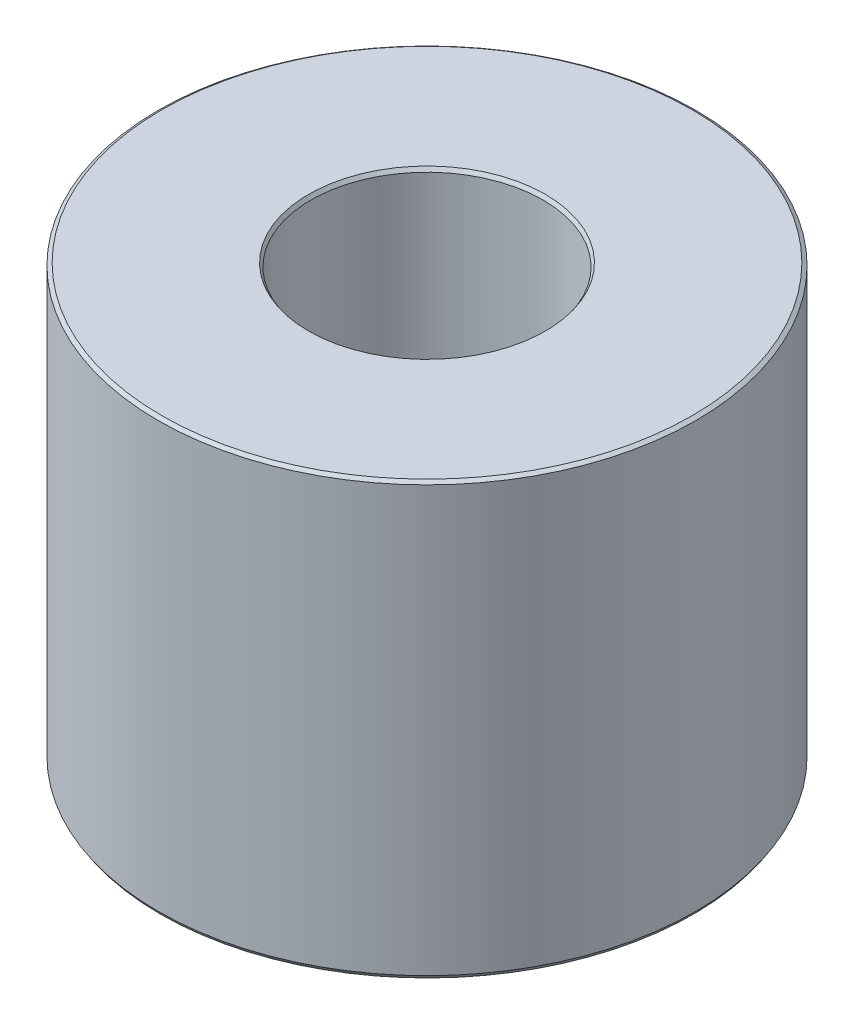
ISO-10303-21;
HEADER;
FILE_DESCRIPTION(('STEP AP214'),'2;1');
FILE_NAME('part.step','',(''),(''),'','','');
FILE_SCHEMA(('AUTOMOTIVE_DESIGN { 1 0 10303 214 1 1 1 1 }'));
ENDSEC;
DATA;
#1=APPLICATION_CONTEXT('core data for automotive mechanical design processes');
#2=APPLICATION_PROTOCOL_DEFINITION('international standard','automotive_design',2000,#1);
#3=PRODUCT_CONTEXT('',#1,'mechanical');
#4=PRODUCT('Part','Part','',(#3));
#5=PRODUCT_RELATED_PRODUCT_CATEGORY('part','',(#4));
#6=PRODUCT_DEFINITION_FORMATION('','',#4);
#7=PRODUCT_DEFINITION_CONTEXT('part definition',#1,'design');
#8=PRODUCT_DEFINITION('design','',#6,#7);
#9=PRODUCT_DEFINITION_SHAPE('','',#8);
#10=(LENGTH_UNIT() NAMED_UNIT(*) SI_UNIT(.MILLI.,.METRE.));
#11=(NAMED_UNIT(*) PLANE_ANGLE_UNIT() SI_UNIT($,.RADIAN.));
#12=(NAMED_UNIT(*) SI_UNIT($,.STERADIAN.) SOLID_ANGLE_UNIT());
#13=UNCERTAINTY_MEASURE_WITH_UNIT(LENGTH_MEASURE(1.E-05),#10,'distance_accuracy_value','');
#14=(GEOMETRIC_REPRESENTATION_CONTEXT(3) GLOBAL_UNCERTAINTY_ASSIGNED_CONTEXT((#13)) GLOBAL_UNIT_ASSIGNED_CONTEXT((#10,
#11,#12)) REPRESENTATION_CONTEXT('',''));
#15=CARTESIAN_POINT('',(0.,0.,0.));
#16=DIRECTION('',(0.,0.,1.));
#17=DIRECTION('',(1.,0.,0.));
#18=AXIS2_PLACEMENT_3D('',#15,#16,#17);
#19=CARTESIAN_POINT('',(0.,92.2311962001684,0.));
#20=DIRECTION('',(0.,-1.,0.));
#21=DIRECTION('',(0.,0.,-1.));
#22=AXIS2_PLACEMENT_3D('',#19,#20,#21);
#23=CYLINDRICAL_SURFACE('',#22,57.5);
#24=CARTESIAN_POINT('',(0.,0.786990859813083,0.));
#25=DIRECTION('',(0.,1.,0.));
#26=DIRECTION('',(0.,0.,1.));
#27=AXIS2_PLACEMENT_3D('',#24,#25,#26);
#28=CIRCLE('',#27,57.5);
#29=CARTESIAN_POINT('',(0.,0.786990859813083,-57.5));
#30=VERTEX_POINT('',#29);
#31=EDGE_CURVE('E10',#30,#30,#28,.T.);
#32=CARTESIAN_POINT('',(0.,91.7238870551304,0.));
#33=DIRECTION('',(0.,1.,0.));
#34=DIRECTION('',(0.,0.,1.));
#35=AXIS2_PLACEMENT_3D('',#32,#33,#34);
#36=CIRCLE('',#35,57.5);
#37=CARTESIAN_POINT('',(0.,91.7238870551304,-57.5));
#38=VERTEX_POINT('',#37);
#39=EDGE_CURVE('E50',#38,#38,#36,.F.);
#40=CARTESIAN_POINT('',(0.,0.786990859813083,-57.5));
#41=CARTESIAN_POINT('',(0.,1.73425019518097,-57.5));
#42=CARTESIAN_POINT('',(0.,2.68150953054886,-57.5));
#43=CARTESIAN_POINT('',(0.,4.57602820128464,-57.5));
#44=CARTESIAN_POINT('',(0.,5.52328753665253,-57.5));
#45=CARTESIAN_POINT('',(0.,7.41780620738831,-57.5));
#46=CARTESIAN_POINT('',(0.,8.3650655427562,-57.5));
#47=CARTESIAN_POINT('',(0.,10.259584213492,-57.5));
#48=CARTESIAN_POINT('',(0.,11.2068435488599,-57.5));
#49=CARTESIAN_POINT('',(0.,13.1013622195956,-57.5));
#50=CARTESIAN_POINT('',(0.,14.0486215549635,-57.5));
#51=CARTESIAN_POINT('',(0.,15.9431402256993,-57.5));
#52=CARTESIAN_POINT('',(0.,16.8903995610672,-57.5));
#53=CARTESIAN_POINT('',(0.,18.784918231803,-57.5));
#54=CARTESIAN_POINT('',(0.,19.7321775671709,-57.5));
#55=CARTESIAN_POINT('',(0.,21.6266962379066,-57.5));
#56=CARTESIAN_POINT('',(0.,22.5739555732745,-57.5));
#57=CARTESIAN_POINT('',(0.,24.4684742440103,-57.5));
#58=CARTESIAN_POINT('',(0.,25.4157335793782,-57.5));
#59=CARTESIAN_POINT('',(0.,27.310252250114,-57.5));
#60=CARTESIAN_POINT('',(0.,28.2575115854819,-57.5));
#61=CARTESIAN_POINT('',(0.,30.1520302562176,-57.5));
#62=CARTESIAN_POINT('',(0.,31.0992895915855,-57.5));
#63=CARTESIAN_POINT('',(0.,32.9938082623213,-57.5));
#64=CARTESIAN_POINT('',(0.,33.9410675976892,-57.5));
#65=CARTESIAN_POINT('',(0.,35.835586268425,-57.5));
#66=CARTESIAN_POINT('',(0.,36.7828456037929,-57.5));
#67=CARTESIAN_POINT('',(0.,38.6773642745286,-57.5));
#68=CARTESIAN_POINT('',(0.,39.6246236098965,-57.5));
#69=CARTESIAN_POINT('',(0.,41.5191422806323,-57.5));
#70=CARTESIAN_POINT('',(0.,42.4664016160002,-57.5));
#71=CARTESIAN_POINT('',(0.,44.360920286736,-57.5));
#72=CARTESIAN_POINT('',(0.,45.3081796221039,-57.5));
#73=CARTESIAN_POINT('',(0.,47.2026982928396,-57.5));
#74=CARTESIAN_POINT('',(0.,48.1499576282075,-57.5));
#75=CARTESIAN_POINT('',(0.,50.0444762989433,-57.5));
#76=CARTESIAN_POINT('',(0.,50.9917356343112,-57.5));
#77=CARTESIAN_POINT('',(0.,52.886254305047,-57.5));
#78=CARTESIAN_POINT('',(0.,53.8335136404149,-57.5));
#79=CARTESIAN_POINT('',(0.,55.7280323111506,-57.5));
#80=CARTESIAN_POINT('',(0.,56.6752916465185,-57.5));
#81=CARTESIAN_POINT('',(0.,58.5698103172543,-57.5));
#82=CARTESIAN_POINT('',(0.,59.5170696526222,-57.5));
#83=CARTESIAN_POINT('',(0.,61.411588323358,-57.5));
#84=CARTESIAN_POINT('',(0.,62.3588476587259,-57.5));
#85=CARTESIAN_POINT('',(0.,64.2533663294616,-57.5));
#86=CARTESIAN_POINT('',(0.,65.2006256648295,-57.5));
#87=CARTESIAN_POINT('',(0.,67.0951443355653,-57.5));
#88=CARTESIAN_POINT('',(0.,68.0424036709332,-57.5));
#89=CARTESIAN_POINT('',(0.,69.936922341669,-57.5));
#90=CARTESIAN_POINT('',(0.,70.8841816770369,-57.5));
#91=CARTESIAN_POINT('',(0.,72.7787003477726,-57.5));
#92=CARTESIAN_POINT('',(0.,73.7259596831405,-57.5));
#93=CARTESIAN_POINT('',(0.,75.6204783538763,-57.5));
#94=CARTESIAN_POINT('',(0.,76.5677376892442,-57.5));
#95=CARTESIAN_POINT('',(0.,78.46225635998,-57.5));
#96=CARTESIAN_POINT('',(0.,79.4095156953479,-57.5));
#97=CARTESIAN_POINT('',(0.,81.3040343660836,-57.5));
#98=CARTESIAN_POINT('',(0.,82.2512937014515,-57.5));
#99=CARTESIAN_POINT('',(0.,84.1458123721873,-57.5));
#100=CARTESIAN_POINT('',(0.,85.0930717075552,-57.5));
#101=CARTESIAN_POINT('',(0.,86.987590378291,-57.5));
#102=CARTESIAN_POINT('',(0.,87.9348497136589,-57.5));
#103=CARTESIAN_POINT('',(0.,89.8293683843947,-57.5));
#104=CARTESIAN_POINT('',(0.,90.7766277197625,-57.5));
#105=CARTESIAN_POINT('',(0.,91.7238870551304,-57.5));
#106=B_SPLINE_CURVE_WITH_KNOTS('',3,(#40,#41,#42,#43,#44,#45,#46,#47,#48,#49,#50,#51,#52,#53,
#54,#55,#56,#57,#58,#59,#60,#61,#62,#63,#64,#65,#66,#67,#68,#69,#70,#71,#72,#73,#74,#75,#76,#77,
#78,#79,#80,#81,#82,#83,#84,#85,#86,#87,#88,#89,#90,#91,#92,#93,#94,#95,#96,#97,#98,#99,#100,
#101,#102,#103,#104,#105),.UNSPECIFIED.,.F.,.F.,(4,2,2,2,2,2,2,2,2,2,2,2,2,2,2,2,2,2,2,2,2,2,2,
2,2,2,2,2,2,2,2,2,4),(0.,2.84177800610366,5.68355601220734,8.525334018311,11.3671120244147,
14.2088900305183,17.050668036622,19.8924460427257,22.7342240488293,25.576002054933,
28.4177800610367,31.2595580671403,34.101336073244,36.9431140793477,39.7848920854513,
42.626670091555,45.4684480976587,48.3102261037623,51.152004109866,53.9937821159697,
56.8355601220733,59.677338128177,62.5191161342807,65.3608941403843,68.202672146488,
71.0444501525917,73.8862281586953,76.728006164799,79.5697841709027,82.4115621770063,
85.25334018311,88.0951181892137,90.9368961953173),.UNSPECIFIED.);
#107=EDGE_CURVE('BSEAM39',#30,#38,#106,.T.);
#108=ORIENTED_EDGE('',*,*,#31,.T.);
#109=ORIENTED_EDGE('',*,*,#39,.T.);
#110=ORIENTED_EDGE('',*,*,#107,.T.);
#111=ORIENTED_EDGE('',*,*,#107,.F.);
#112=EDGE_LOOP('',(#108,#110,#109,#111));
#113=FACE_BOUND('',#112,.T.);
#114=ADVANCED_FACE('F39',(#113),#23,.T.);
#115=CARTESIAN_POINT('',(0.,92.2311962001684,0.));
#116=DIRECTION('',(0.,1.,0.));
#117=DIRECTION('',(0.,0.,1.));
#118=AXIS2_PLACEMENT_3D('',#115,#116,#117);
#119=PLANE('',#118);
#120=CARTESIAN_POINT('',(0.,92.2311962001684,0.));
#121=DIRECTION('',(0.,1.,0.));
#122=DIRECTION('',(0.,0.,1.));
#123=AXIS2_PLACEMENT_3D('',#120,#121,#122);
#124=CIRCLE('',#123,25.3377597654648);
#125=CARTESIAN_POINT('',(0.,92.2311962001684,25.3377597654648));
#126=VERTEX_POINT('',#125);
#127=EDGE_CURVE('E58',#126,#126,#124,.F.);
#128=ORIENTED_EDGE('',*,*,#127,.T.);
#129=EDGE_LOOP('',(#128));
#130=FACE_BOUND('',#129,.T.);
#131=CARTESIAN_POINT('',(0.,92.2311962001684,0.));
#132=DIRECTION('',(0.,1.,0.));
#133=DIRECTION('',(0.,0.,1.));
#134=AXIS2_PLACEMENT_3D('',#131,#132,#133);
#135=CIRCLE('',#134,56.7130091401871);
#136=CARTESIAN_POINT('',(0.,92.2311962001684,56.7130091401871));
#137=VERTEX_POINT('',#136);
#138=EDGE_CURVE('E61',#137,#137,#135,.T.);
#139=ORIENTED_EDGE('',*,*,#138,.T.);
#140=EDGE_LOOP('',(#139));
#141=FACE_BOUND('',#140,.T.);
#142=ADVANCED_FACE('F88',(#130,#141),#119,.T.);
#143=CARTESIAN_POINT('',(0.,0.,0.));
#144=DIRECTION('',(0.,1.,0.));
#145=DIRECTION('',(0.,0.,1.));
#146=AXIS2_PLACEMENT_3D('',#143,#144,#145);
#147=PLANE('',#146);
#148=CARTESIAN_POINT('',(0.,0.,0.));
#149=DIRECTION('',(0.,1.,0.));
#150=DIRECTION('',(0.,0.,1.));
#151=AXIS2_PLACEMENT_3D('',#148,#149,#150);
#152=CIRCLE('',#151,25.6174414802395);
#153=CARTESIAN_POINT('',(0.,0.,25.6174414802395));
#154=VERTEX_POINT('',#153);
#155=EDGE_CURVE('E51',#154,#154,#152,.T.);
#156=ORIENTED_EDGE('',*,*,#155,.T.);
#157=EDGE_LOOP('',(#156));
#158=FACE_BOUND('',#157,.T.);
#159=CARTESIAN_POINT('',(0.,0.,0.));
#160=DIRECTION('',(0.,1.,0.));
#161=DIRECTION('',(0.,0.,1.));
#162=AXIS2_PLACEMENT_3D('',#159,#160,#161);
#163=CIRCLE('',#162,56.9926908549619);
#164=CARTESIAN_POINT('',(0.,0.,56.9926908549619));
#165=VERTEX_POINT('',#164);
#166=EDGE_CURVE('E54',#165,#165,#163,.F.);
#167=ORIENTED_EDGE('',*,*,#166,.T.);
#168=EDGE_LOOP('',(#167));
#169=FACE_BOUND('',#168,.T.);
#170=ADVANCED_FACE('F83',(#158,#169),#147,.F.);
#171=CARTESIAN_POINT('',(0.,92.2311962001684,0.));
#172=DIRECTION('',(0.,-1.,0.));
#173=DIRECTION('',(0.,0.,-1.));
#174=AXIS2_PLACEMENT_3D('',#171,#172,#173);
#175=CYLINDRICAL_SURFACE('',#174,24.8304506204267);
#176=CARTESIAN_POINT('',(0.,91.4442053403554,0.));
#177=DIRECTION('',(0.,1.,0.));
#178=DIRECTION('',(0.,0.,1.));
#179=AXIS2_PLACEMENT_3D('',#176,#177,#178);
#180=CIRCLE('',#179,24.8304506204267);
#181=CARTESIAN_POINT('',(0.,91.4442053403553,-24.8304506204267));
#182=VERTEX_POINT('',#181);
#183=EDGE_CURVE('E67',#182,#182,#180,.T.);
#184=CARTESIAN_POINT('',(0.,0.507309145037924,0.));
#185=DIRECTION('',(0.,1.,0.));
#186=DIRECTION('',(0.,0.,1.));
#187=AXIS2_PLACEMENT_3D('',#184,#185,#186);
#188=CIRCLE('',#187,24.8304506204267);
#189=CARTESIAN_POINT('',(0.,0.507309145037924,-24.8304506204267));
#190=VERTEX_POINT('',#189);
#191=EDGE_CURVE('E69',#190,#190,#188,.F.);
#192=CARTESIAN_POINT('',(0.,91.4442053403553,-24.8304506204267));
#193=CARTESIAN_POINT('',(0.,90.4969460049874,-24.8304506204267));
#194=CARTESIAN_POINT('',(0.,89.5496866696196,-24.8304506204267));
#195=CARTESIAN_POINT('',(0.,87.6551679988838,-24.8304506204267));
#196=CARTESIAN_POINT('',(0.,86.7079086635159,-24.8304506204267));
#197=CARTESIAN_POINT('',(0.,84.8133899927801,-24.8304506204267));
#198=CARTESIAN_POINT('',(0.,83.8661306574122,-24.8304506204267));
#199=CARTESIAN_POINT('',(0.,81.9716119866765,-24.8304506204267));
#200=CARTESIAN_POINT('',(0.,81.0243526513086,-24.8304506204267));
#201=CARTESIAN_POINT('',(0.,79.1298339805728,-24.8304506204267));
#202=CARTESIAN_POINT('',(0.,78.1825746452049,-24.8304506204267));
#203=CARTESIAN_POINT('',(0.,76.2880559744691,-24.8304506204267));
#204=CARTESIAN_POINT('',(0.,75.3407966391012,-24.8304506204267));
#205=CARTESIAN_POINT('',(0.,73.4462779683654,-24.8304506204267));
#206=CARTESIAN_POINT('',(0.,72.4990186329976,-24.8304506204267));
#207=CARTESIAN_POINT('',(0.,70.6044999622618,-24.8304506204267));
#208=CARTESIAN_POINT('',(0.,69.6572406268939,-24.8304506204267));
#209=CARTESIAN_POINT('',(0.,67.7627219561581,-24.8304506204267));
#210=CARTESIAN_POINT('',(0.,66.8154626207902,-24.8304506204267));
#211=CARTESIAN_POINT('',(0.,64.9209439500544,-24.8304506204267));
#212=CARTESIAN_POINT('',(0.,63.9736846146865,-24.8304506204267));
#213=CARTESIAN_POINT('',(0.,62.0791659439508,-24.8304506204267));
#214=CARTESIAN_POINT('',(0.,61.1319066085829,-24.8304506204267));
#215=CARTESIAN_POINT('',(0.,59.2373879378471,-24.8304506204267));
#216=CARTESIAN_POINT('',(0.,58.2901286024792,-24.8304506204267));
#217=CARTESIAN_POINT('',(0.,56.3956099317434,-24.8304506204267));
#218=CARTESIAN_POINT('',(0.,55.4483505963755,-24.8304506204267));
#219=CARTESIAN_POINT('',(0.,53.5538319256398,-24.8304506204267));
#220=CARTESIAN_POINT('',(0.,52.6065725902719,-24.8304506204267));
#221=CARTESIAN_POINT('',(0.,50.7120539195361,-24.8304506204267));
#222=CARTESIAN_POINT('',(0.,49.7647945841682,-24.8304506204267));
#223=CARTESIAN_POINT('',(0.,47.8702759134324,-24.8304506204267));
#224=CARTESIAN_POINT('',(0.,46.9230165780645,-24.8304506204267));
#225=CARTESIAN_POINT('',(0.,45.0284979073287,-24.8304506204267));
#226=CARTESIAN_POINT('',(0.,44.0812385719609,-24.8304506204267));
#227=CARTESIAN_POINT('',(0.,42.1867199012251,-24.8304506204267));
#228=CARTESIAN_POINT('',(0.,41.2394605658572,-24.8304506204267));
#229=CARTESIAN_POINT('',(0.,39.3449418951214,-24.8304506204267));
#230=CARTESIAN_POINT('',(0.,38.3976825597535,-24.8304506204267));
#231=CARTESIAN_POINT('',(0.,36.5031638890177,-24.8304506204267));
#232=CARTESIAN_POINT('',(0.,35.5559045536499,-24.8304506204267));
#233=CARTESIAN_POINT('',(0.,33.6613858829141,-24.8304506204267));
#234=CARTESIAN_POINT('',(0.,32.7141265475462,-24.8304506204267));
#235=CARTESIAN_POINT('',(0.,30.8196078768104,-24.8304506204267));
#236=CARTESIAN_POINT('',(0.,29.8723485414425,-24.8304506204267));
#237=CARTESIAN_POINT('',(0.,27.9778298707067,-24.8304506204267));
#238=CARTESIAN_POINT('',(0.,27.0305705353388,-24.8304506204267));
#239=CARTESIAN_POINT('',(0.,25.1360518646031,-24.8304506204267));
#240=CARTESIAN_POINT('',(0.,24.1887925292352,-24.8304506204267));
#241=CARTESIAN_POINT('',(0.,22.2942738584994,-24.8304506204267));
#242=CARTESIAN_POINT('',(0.,21.3470145231315,-24.8304506204267));
#243=CARTESIAN_POINT('',(0.,19.4524958523957,-24.8304506204267));
#244=CARTESIAN_POINT('',(0.,18.5052365170278,-24.8304506204267));
#245=CARTESIAN_POINT('',(0.,16.6107178462921,-24.8304506204267));
#246=CARTESIAN_POINT('',(0.,15.6634585109242,-24.8304506204267));
#247=CARTESIAN_POINT('',(0.,13.7689398401884,-24.8304506204267));
#248=CARTESIAN_POINT('',(0.,12.8216805048205,-24.8304506204267));
#249=CARTESIAN_POINT('',(0.,10.9271618340847,-24.8304506204267));
#250=CARTESIAN_POINT('',(0.,9.97990249871683,-24.8304506204267));
#251=CARTESIAN_POINT('',(0.,8.08538382798105,-24.8304506204267));
#252=CARTESIAN_POINT('',(0.,7.13812449261315,-24.8304506204267));
#253=CARTESIAN_POINT('',(0.,5.24360582187737,-24.8304506204267));
#254=CARTESIAN_POINT('',(0.,4.29634648650949,-24.8304506204267));
#255=CARTESIAN_POINT('',(0.,2.40182781577371,-24.8304506204267));
#256=CARTESIAN_POINT('',(0.,1.45456848040582,-24.8304506204267));
#257=CARTESIAN_POINT('',(0.,0.507309145037924,-24.8304506204267));
#258=B_SPLINE_CURVE_WITH_KNOTS('',3,(#192,#193,#194,#195,#196,#197,#198,#199,#200,#201,#202,
#203,#204,#205,#206,#207,#208,#209,#210,#211,#212,#213,#214,#215,#216,#217,#218,#219,#220,#221,
#222,#223,#224,#225,#226,#227,#228,#229,#230,#231,#232,#233,#234,#235,#236,#237,#238,#239,#240,
#241,#242,#243,#244,#245,#246,#247,#248,#249,#250,#251,#252,#253,#254,#255,#256,#257),
.UNSPECIFIED.,.F.,.F.,(4,2,2,2,2,2,2,2,2,2,2,2,2,2,2,2,2,2,2,2,2,2,2,2,2,2,2,2,2,2,2,2,4),(0.,
2.84177800610366,5.68355601220734,8.525334018311,11.3671120244147,14.2088900305183,
17.050668036622,19.8924460427257,22.7342240488293,25.576002054933,28.4177800610367,
31.2595580671404,34.101336073244,36.9431140793477,39.7848920854514,42.626670091555,
45.4684480976587,48.3102261037624,51.152004109866,53.9937821159697,56.8355601220734,
59.677338128177,62.5191161342807,65.3608941403844,68.2026721464881,71.0444501525917,
73.8862281586954,76.7280061647991,79.5697841709027,82.4115621770064,85.2533401831101,
88.0951181892137,90.9368961953174),.UNSPECIFIED.);
#259=EDGE_CURVE('BSEAM71',#182,#190,#258,.T.);
#260=ORIENTED_EDGE('',*,*,#183,.T.);
#261=ORIENTED_EDGE('',*,*,#191,.T.);
#262=ORIENTED_EDGE('',*,*,#259,.T.);
#263=ORIENTED_EDGE('',*,*,#259,.F.);
#264=EDGE_LOOP('',(#260,#262,#261,#263));
#265=FACE_BOUND('',#264,.T.);
#266=ADVANCED_FACE('F71',(#265),#175,.F.);
#267=CARTESIAN_POINT('',(0.,91.4442053403554,0.));
#268=DIRECTION('',(0.,1.,0.));
#269=DIRECTION('',(0.,0.,1.));
#270=AXIS2_PLACEMENT_3D('',#267,#268,#269);
#271=CONICAL_SURFACE('',#270,24.8304506204267,0.572583033780805);
#272=ORIENTED_EDGE('',*,*,#127,.F.);
#273=EDGE_LOOP('',(#272));
#274=FACE_BOUND('',#273,.T.);
#275=ORIENTED_EDGE('',*,*,#183,.F.);
#276=EDGE_LOOP('',(#275));
#277=FACE_BOUND('',#276,.T.);
#278=ADVANCED_FACE('F77',(#274,#277),#271,.F.);
#279=CARTESIAN_POINT('',(0.,0.,0.));
#280=DIRECTION('',(0.,-1.,0.));
#281=DIRECTION('',(0.,0.,-1.));
#282=AXIS2_PLACEMENT_3D('',#279,#280,#281);
#283=CONICAL_SURFACE('',#282,25.6174414802395,0.998213293014088);
#284=ORIENTED_EDGE('',*,*,#191,.F.);
#285=EDGE_LOOP('',(#284));
#286=FACE_BOUND('',#285,.T.);
#287=ORIENTED_EDGE('',*,*,#155,.F.);
#288=EDGE_LOOP('',(#287));
#289=FACE_BOUND('',#288,.T.);
#290=ADVANCED_FACE('F73',(#286,#289),#283,.F.);
#291=CARTESIAN_POINT('',(0.,0.786990859813083,0.));
#292=DIRECTION('',(0.,1.,0.));
#293=DIRECTION('',(0.,0.,1.));
#294=AXIS2_PLACEMENT_3D('',#291,#292,#293);
#295=CONICAL_SURFACE('',#294,57.5,0.572583033780813);
#296=ORIENTED_EDGE('',*,*,#166,.F.);
#297=EDGE_LOOP('',(#296));
#298=FACE_BOUND('',#297,.T.);
#299=ORIENTED_EDGE('',*,*,#31,.F.);
#300=EDGE_LOOP('',(#299));
#301=FACE_BOUND('',#300,.T.);
#302=ADVANCED_FACE('F76',(#298,#301),#295,.T.);
#303=CARTESIAN_POINT('',(0.,92.2311962001684,0.));
#304=DIRECTION('',(0.,-1.,0.));
#305=DIRECTION('',(0.,0.,-1.));
#306=AXIS2_PLACEMENT_3D('',#303,#304,#305);
#307=CONICAL_SURFACE('',#306,56.7130091401871,0.99821329301408);
#308=ORIENTED_EDGE('',*,*,#39,.F.);
#309=EDGE_LOOP('',(#308));
#310=FACE_BOUND('',#309,.T.);
#311=ORIENTED_EDGE('',*,*,#138,.F.);
#312=EDGE_LOOP('',(#311));
#313=FACE_BOUND('',#312,.T.);
#314=ADVANCED_FACE('F45',(#310,#313),#307,.T.);
#315=CLOSED_SHELL('',(#114,#142,#170,#266,#278,#290,#302,#314));
#316=MANIFOLD_SOLID_BREP('B2',#315);
#317=ADVANCED_BREP_SHAPE_REPRESENTATION('',(#18,#316),#14);
#318=SHAPE_DEFINITION_REPRESENTATION(#9,#317);
ENDSEC;
END-ISO-10303-21;
